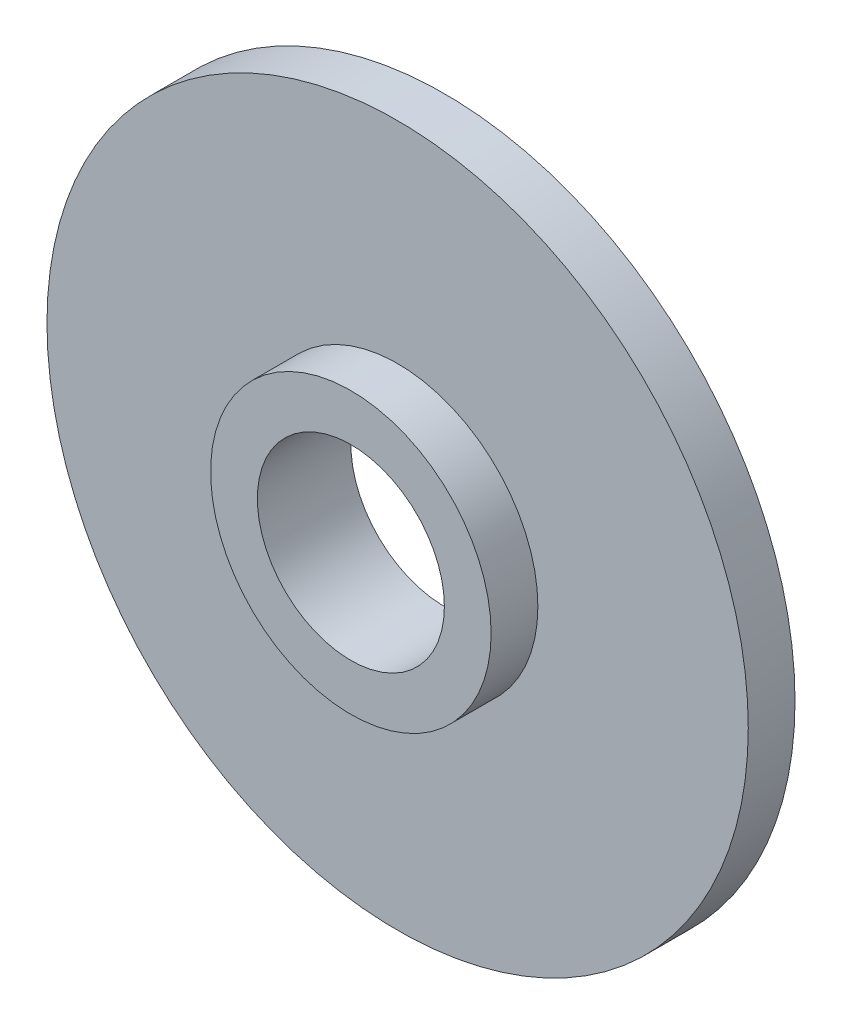
ISO-10303-21;
HEADER;
FILE_DESCRIPTION(('STEP AP214'),'2;1');
FILE_NAME('part.step','',(''),(''),'','','');
FILE_SCHEMA(('AUTOMOTIVE_DESIGN { 1 0 10303 214 1 1 1 1 }'));
ENDSEC;
DATA;
#1=APPLICATION_CONTEXT('core data for automotive mechanical design processes');
#2=APPLICATION_PROTOCOL_DEFINITION('international standard','automotive_design',2000,#1);
#3=PRODUCT_CONTEXT('',#1,'mechanical');
#4=PRODUCT('Part','Part','',(#3));
#5=PRODUCT_RELATED_PRODUCT_CATEGORY('part','',(#4));
#6=PRODUCT_DEFINITION_FORMATION('','',#4);
#7=PRODUCT_DEFINITION_CONTEXT('part definition',#1,'design');
#8=PRODUCT_DEFINITION('design','',#6,#7);
#9=PRODUCT_DEFINITION_SHAPE('','',#8);
#10=(LENGTH_UNIT() NAMED_UNIT(*) SI_UNIT(.MILLI.,.METRE.));
#11=(NAMED_UNIT(*) PLANE_ANGLE_UNIT() SI_UNIT($,.RADIAN.));
#12=(NAMED_UNIT(*) SI_UNIT($,.STERADIAN.) SOLID_ANGLE_UNIT());
#13=UNCERTAINTY_MEASURE_WITH_UNIT(LENGTH_MEASURE(1.E-05),#10,'distance_accuracy_value','');
#14=(GEOMETRIC_REPRESENTATION_CONTEXT(3) GLOBAL_UNCERTAINTY_ASSIGNED_CONTEXT((#13)) GLOBAL_UNIT_ASSIGNED_CONTEXT((#10,
#11,#12)) REPRESENTATION_CONTEXT('',''));
#15=CARTESIAN_POINT('',(0.,0.,0.));
#16=DIRECTION('',(0.,0.,1.));
#17=DIRECTION('',(1.,0.,0.));
#18=AXIS2_PLACEMENT_3D('',#15,#16,#17);
#19=CARTESIAN_POINT('',(0.,0.,1.));
#20=DIRECTION('',(0.,0.,1.));
#21=DIRECTION('',(1.,0.,0.));
#22=AXIS2_PLACEMENT_3D('',#19,#20,#21);
#23=PLANE('',#22);
#24=CARTESIAN_POINT('',(0.,0.,1.));
#25=DIRECTION('',(0.,0.,1.));
#26=DIRECTION('',(1.,0.,0.));
#27=AXIS2_PLACEMENT_3D('',#24,#25,#26);
#28=CIRCLE('',#27,7.5);
#29=CARTESIAN_POINT('',(7.5,0.,1.));
#30=VERTEX_POINT('',#29);
#31=EDGE_CURVE('E10',#30,#30,#28,.T.);
#32=ORIENTED_EDGE('',*,*,#31,.T.);
#33=EDGE_LOOP('',(#32));
#34=FACE_BOUND('',#33,.T.);
#35=CARTESIAN_POINT('',(0.,0.,1.));
#36=DIRECTION('',(0.,0.,1.));
#37=DIRECTION('',(1.,0.,0.));
#38=AXIS2_PLACEMENT_3D('',#35,#36,#37);
#39=CIRCLE('',#38,3.);
#40=CARTESIAN_POINT('',(3.,0.,1.));
#41=VERTEX_POINT('',#40);
#42=EDGE_CURVE('E47',#41,#41,#39,.T.);
#43=ORIENTED_EDGE('',*,*,#42,.F.);
#44=EDGE_LOOP('',(#43));
#45=FACE_BOUND('',#44,.T.);
#46=ADVANCED_FACE('F31',(#34,#45),#23,.T.);
#47=CARTESIAN_POINT('',(0.,0.,0.));
#48=DIRECTION('',(0.,0.,1.));
#49=DIRECTION('',(1.,0.,0.));
#50=AXIS2_PLACEMENT_3D('',#47,#48,#49);
#51=PLANE('',#50);
#52=CARTESIAN_POINT('',(0.,0.,0.));
#53=DIRECTION('',(0.,0.,1.));
#54=DIRECTION('',(1.,0.,0.));
#55=AXIS2_PLACEMENT_3D('',#52,#53,#54);
#56=CIRCLE('',#55,7.5);
#57=CARTESIAN_POINT('',(7.5,0.,0.));
#58=VERTEX_POINT('',#57);
#59=EDGE_CURVE('E35',#58,#58,#56,.T.);
#60=ORIENTED_EDGE('',*,*,#59,.F.);
#61=EDGE_LOOP('',(#60));
#62=FACE_BOUND('',#61,.T.);
#63=CARTESIAN_POINT('',(0.,0.,0.));
#64=DIRECTION('',(0.,0.,1.));
#65=DIRECTION('',(1.,0.,0.));
#66=AXIS2_PLACEMENT_3D('',#63,#64,#65);
#67=CIRCLE('',#66,2.);
#68=CARTESIAN_POINT('',(2.,0.,0.));
#69=VERTEX_POINT('',#68);
#70=EDGE_CURVE('E42',#69,#69,#67,.T.);
#71=ORIENTED_EDGE('',*,*,#70,.T.);
#72=EDGE_LOOP('',(#71));
#73=FACE_BOUND('',#72,.T.);
#74=ADVANCED_FACE('F72',(#62,#73),#51,.F.);
#75=CARTESIAN_POINT('',(0.,0.,1.));
#76=DIRECTION('',(0.,0.,-1.));
#77=DIRECTION('',(-1.,0.,0.));
#78=AXIS2_PLACEMENT_3D('',#75,#76,#77);
#79=CYLINDRICAL_SURFACE('',#78,7.5);
#80=ORIENTED_EDGE('',*,*,#31,.F.);
#81=EDGE_LOOP('',(#80));
#82=FACE_BOUND('',#81,.T.);
#83=ORIENTED_EDGE('',*,*,#59,.T.);
#84=EDGE_LOOP('',(#83));
#85=FACE_BOUND('',#84,.T.);
#86=ADVANCED_FACE('F33',(#82,#85),#79,.T.);
#87=CARTESIAN_POINT('',(0.,0.,1.));
#88=DIRECTION('',(0.,0.,-1.));
#89=DIRECTION('',(-1.,0.,0.));
#90=AXIS2_PLACEMENT_3D('',#87,#88,#89);
#91=CYLINDRICAL_SURFACE('',#90,2.);
#92=ORIENTED_EDGE('',*,*,#70,.F.);
#93=EDGE_LOOP('',(#92));
#94=FACE_BOUND('',#93,.T.);
#95=CARTESIAN_POINT('',(0.,0.,2.));
#96=DIRECTION('',(0.,0.,1.));
#97=DIRECTION('',(1.,0.,0.));
#98=AXIS2_PLACEMENT_3D('',#95,#96,#97);
#99=CIRCLE('',#98,2.);
#100=CARTESIAN_POINT('',(2.,0.,2.));
#101=VERTEX_POINT('',#100);
#102=EDGE_CURVE('E50',#101,#101,#99,.T.);
#103=ORIENTED_EDGE('',*,*,#102,.T.);
#104=EDGE_LOOP('',(#103));
#105=FACE_BOUND('',#104,.T.);
#106=ADVANCED_FACE('F56',(#94,#105),#91,.F.);
#107=CARTESIAN_POINT('',(0.,0.,2.));
#108=DIRECTION('',(0.,0.,1.));
#109=DIRECTION('',(1.,0.,0.));
#110=AXIS2_PLACEMENT_3D('',#107,#108,#109);
#111=PLANE('',#110);
#112=CARTESIAN_POINT('',(0.,0.,2.));
#113=DIRECTION('',(0.,0.,1.));
#114=DIRECTION('',(1.,0.,0.));
#115=AXIS2_PLACEMENT_3D('',#112,#113,#114);
#116=CIRCLE('',#115,3.);
#117=CARTESIAN_POINT('',(3.,0.,2.));
#118=VERTEX_POINT('',#117);
#119=EDGE_CURVE('E46',#118,#118,#116,.T.);
#120=ORIENTED_EDGE('',*,*,#119,.T.);
#121=EDGE_LOOP('',(#120));
#122=FACE_BOUND('',#121,.T.);
#123=ORIENTED_EDGE('',*,*,#102,.F.);
#124=EDGE_LOOP('',(#123));
#125=FACE_BOUND('',#124,.T.);
#126=ADVANCED_FACE('F58',(#122,#125),#111,.T.);
#127=CARTESIAN_POINT('',(0.,0.,2.));
#128=DIRECTION('',(0.,0.,-1.));
#129=DIRECTION('',(-1.,0.,0.));
#130=AXIS2_PLACEMENT_3D('',#127,#128,#129);
#131=CYLINDRICAL_SURFACE('',#130,3.);
#132=ORIENTED_EDGE('',*,*,#119,.F.);
#133=EDGE_LOOP('',(#132));
#134=FACE_BOUND('',#133,.T.);
#135=ORIENTED_EDGE('',*,*,#42,.T.);
#136=EDGE_LOOP('',(#135));
#137=FACE_BOUND('',#136,.T.);
#138=ADVANCED_FACE('F60',(#134,#137),#131,.T.);
#139=CLOSED_SHELL('',(#46,#74,#86,#106,#126,#138));
#140=MANIFOLD_SOLID_BREP('B2',#139);
#141=ADVANCED_BREP_SHAPE_REPRESENTATION('',(#18,#140),#14);
#142=SHAPE_DEFINITION_REPRESENTATION(#9,#141);
ENDSEC;
END-ISO-10303-21;
